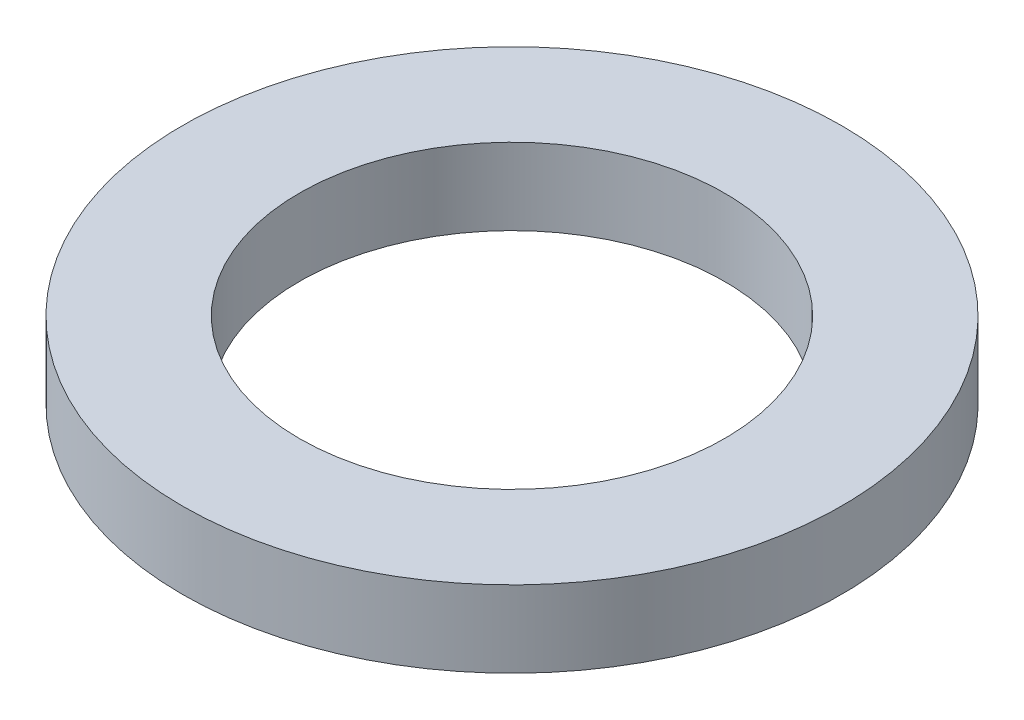
ISO-10303-21;
HEADER;
FILE_DESCRIPTION(('STEP AP214'),'2;1');
FILE_NAME('part.step','',(''),(''),'','','');
FILE_SCHEMA(('AUTOMOTIVE_DESIGN { 1 0 10303 214 1 1 1 1 }'));
ENDSEC;
DATA;
#1=APPLICATION_CONTEXT('core data for automotive mechanical design processes');
#2=APPLICATION_PROTOCOL_DEFINITION('international standard','automotive_design',2000,#1);
#3=PRODUCT_CONTEXT('',#1,'mechanical');
#4=PRODUCT('Part','Part','',(#3));
#5=PRODUCT_RELATED_PRODUCT_CATEGORY('part','',(#4));
#6=PRODUCT_DEFINITION_FORMATION('','',#4);
#7=PRODUCT_DEFINITION_CONTEXT('part definition',#1,'design');
#8=PRODUCT_DEFINITION('design','',#6,#7);
#9=PRODUCT_DEFINITION_SHAPE('','',#8);
#10=(LENGTH_UNIT() NAMED_UNIT(*) SI_UNIT(.MILLI.,.METRE.));
#11=(NAMED_UNIT(*) PLANE_ANGLE_UNIT() SI_UNIT($,.RADIAN.));
#12=(NAMED_UNIT(*) SI_UNIT($,.STERADIAN.) SOLID_ANGLE_UNIT());
#13=UNCERTAINTY_MEASURE_WITH_UNIT(LENGTH_MEASURE(1.E-05),#10,'distance_accuracy_value','');
#14=(GEOMETRIC_REPRESENTATION_CONTEXT(3) GLOBAL_UNCERTAINTY_ASSIGNED_CONTEXT((#13)) GLOBAL_UNIT_ASSIGNED_CONTEXT((#10,
#11,#12)) REPRESENTATION_CONTEXT('',''));
#15=CARTESIAN_POINT('',(0.,0.,0.));
#16=DIRECTION('',(0.,0.,1.));
#17=DIRECTION('',(1.,0.,0.));
#18=AXIS2_PLACEMENT_3D('',#15,#16,#17);
#19=CARTESIAN_POINT('',(0.,18.,0.));
#20=DIRECTION('',(0.,-1.,0.));
#21=DIRECTION('',(0.,0.,-1.));
#22=AXIS2_PLACEMENT_3D('',#19,#20,#21);
#23=CYLINDRICAL_SURFACE('',#22,77.5);
#24=CARTESIAN_POINT('',(0.,18.,0.));
#25=DIRECTION('',(0.,1.,0.));
#26=DIRECTION('',(0.,0.,1.));
#27=AXIS2_PLACEMENT_3D('',#24,#25,#26);
#28=CIRCLE('',#27,77.5);
#29=CARTESIAN_POINT('',(0.,18.,77.5));
#30=VERTEX_POINT('',#29);
#31=EDGE_CURVE('E10',#30,#30,#28,.T.);
#32=ORIENTED_EDGE('',*,*,#31,.F.);
#33=EDGE_LOOP('',(#32));
#34=FACE_BOUND('',#33,.T.);
#35=CARTESIAN_POINT('',(0.,0.,0.));
#36=DIRECTION('',(0.,1.,0.));
#37=DIRECTION('',(0.,0.,1.));
#38=AXIS2_PLACEMENT_3D('',#35,#36,#37);
#39=CIRCLE('',#38,77.5);
#40=CARTESIAN_POINT('',(0.,0.,77.5));
#41=VERTEX_POINT('',#40);
#42=EDGE_CURVE('E37',#41,#41,#39,.T.);
#43=ORIENTED_EDGE('',*,*,#42,.T.);
#44=EDGE_LOOP('',(#43));
#45=FACE_BOUND('',#44,.T.);
#46=ADVANCED_FACE('F40',(#34,#45),#23,.T.);
#47=CARTESIAN_POINT('',(0.,18.,0.));
#48=DIRECTION('',(0.,1.,0.));
#49=DIRECTION('',(0.,0.,1.));
#50=AXIS2_PLACEMENT_3D('',#47,#48,#49);
#51=PLANE('',#50);
#52=CARTESIAN_POINT('',(0.,18.,0.));
#53=DIRECTION('',(0.,1.,0.));
#54=DIRECTION('',(0.,0.,1.));
#55=AXIS2_PLACEMENT_3D('',#52,#53,#54);
#56=CIRCLE('',#55,50.);
#57=CARTESIAN_POINT('',(0.,18.,50.));
#58=VERTEX_POINT('',#57);
#59=EDGE_CURVE('E50',#58,#58,#56,.T.);
#60=ORIENTED_EDGE('',*,*,#59,.F.);
#61=EDGE_LOOP('',(#60));
#62=FACE_BOUND('',#61,.T.);
#63=ORIENTED_EDGE('',*,*,#31,.T.);
#64=EDGE_LOOP('',(#63));
#65=FACE_BOUND('',#64,.T.);
#66=ADVANCED_FACE('F59',(#62,#65),#51,.T.);
#67=CARTESIAN_POINT('',(0.,0.,0.));
#68=DIRECTION('',(0.,1.,0.));
#69=DIRECTION('',(0.,0.,1.));
#70=AXIS2_PLACEMENT_3D('',#67,#68,#69);
#71=PLANE('',#70);
#72=CARTESIAN_POINT('',(0.,0.,0.));
#73=DIRECTION('',(0.,1.,0.));
#74=DIRECTION('',(0.,0.,1.));
#75=AXIS2_PLACEMENT_3D('',#72,#73,#74);
#76=CIRCLE('',#75,50.);
#77=CARTESIAN_POINT('',(0.,0.,50.));
#78=VERTEX_POINT('',#77);
#79=EDGE_CURVE('E47',#78,#78,#76,.T.);
#80=ORIENTED_EDGE('',*,*,#79,.T.);
#81=EDGE_LOOP('',(#80));
#82=FACE_BOUND('',#81,.T.);
#83=ORIENTED_EDGE('',*,*,#42,.F.);
#84=EDGE_LOOP('',(#83));
#85=FACE_BOUND('',#84,.T.);
#86=ADVANCED_FACE('F58',(#82,#85),#71,.F.);
#87=CARTESIAN_POINT('',(0.,18.,0.));
#88=DIRECTION('',(0.,-1.,0.));
#89=DIRECTION('',(0.,0.,-1.));
#90=AXIS2_PLACEMENT_3D('',#87,#88,#89);
#91=CYLINDRICAL_SURFACE('',#90,50.);
#92=ORIENTED_EDGE('',*,*,#59,.T.);
#93=EDGE_LOOP('',(#92));
#94=FACE_BOUND('',#93,.T.);
#95=ORIENTED_EDGE('',*,*,#79,.F.);
#96=EDGE_LOOP('',(#95));
#97=FACE_BOUND('',#96,.T.);
#98=ADVANCED_FACE('F54',(#94,#97),#91,.F.);
#99=CLOSED_SHELL('',(#46,#66,#86,#98));
#100=MANIFOLD_SOLID_BREP('B2',#99);
#101=ADVANCED_BREP_SHAPE_REPRESENTATION('',(#18,#100),#14);
#102=SHAPE_DEFINITION_REPRESENTATION(#9,#101);
ENDSEC;
END-ISO-10303-21;
